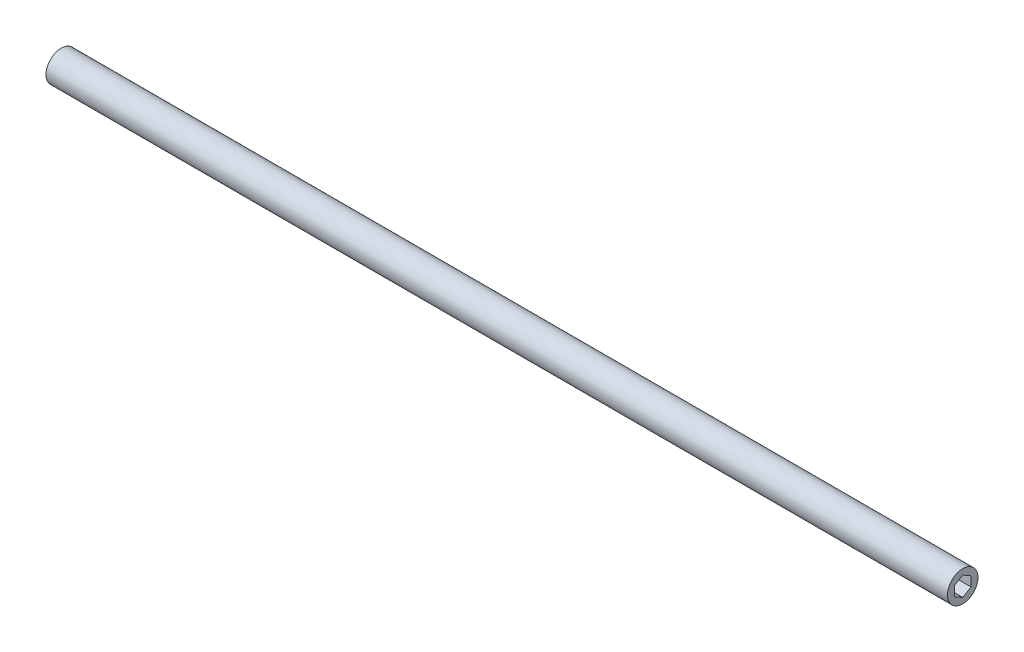
ISO-10303-21;
HEADER;
FILE_DESCRIPTION(('STEP AP214'),'2;1');
FILE_NAME('part.step','',(''),(''),'','','');
FILE_SCHEMA(('AUTOMOTIVE_DESIGN { 1 0 10303 214 1 1 1 1 }'));
ENDSEC;
DATA;
#1=APPLICATION_CONTEXT('core data for automotive mechanical design processes');
#2=APPLICATION_PROTOCOL_DEFINITION('international standard','automotive_design',2000,#1);
#3=PRODUCT_CONTEXT('',#1,'mechanical');
#4=PRODUCT('Part','Part','',(#3));
#5=PRODUCT_RELATED_PRODUCT_CATEGORY('part','',(#4));
#6=PRODUCT_DEFINITION_FORMATION('','',#4);
#7=PRODUCT_DEFINITION_CONTEXT('part definition',#1,'design');
#8=PRODUCT_DEFINITION('design','',#6,#7);
#9=PRODUCT_DEFINITION_SHAPE('','',#8);
#10=(LENGTH_UNIT() NAMED_UNIT(*) SI_UNIT(.MILLI.,.METRE.));
#11=(NAMED_UNIT(*) PLANE_ANGLE_UNIT() SI_UNIT($,.RADIAN.));
#12=(NAMED_UNIT(*) SI_UNIT($,.STERADIAN.) SOLID_ANGLE_UNIT());
#13=UNCERTAINTY_MEASURE_WITH_UNIT(LENGTH_MEASURE(1.E-05),#10,'distance_accuracy_value','');
#14=(GEOMETRIC_REPRESENTATION_CONTEXT(3) GLOBAL_UNCERTAINTY_ASSIGNED_CONTEXT((#13)) GLOBAL_UNIT_ASSIGNED_CONTEXT((#10,
#11,#12)) REPRESENTATION_CONTEXT('',''));
#15=CARTESIAN_POINT('',(0.,0.,0.));
#16=DIRECTION('',(0.,0.,1.));
#17=DIRECTION('',(1.,0.,0.));
#18=AXIS2_PLACEMENT_3D('',#15,#16,#17);
#19=CARTESIAN_POINT('',(682.625,0.,0.));
#20=DIRECTION('',(1.,0.,0.));
#21=DIRECTION('',(0.,0.,-1.));
#22=AXIS2_PLACEMENT_3D('',#19,#20,#21);
#23=PLANE('',#22);
#24=CARTESIAN_POINT('',(682.625,0.,0.));
#25=DIRECTION('',(1.,0.,0.));
#26=DIRECTION('',(0.,0.,-1.));
#27=AXIS2_PLACEMENT_3D('',#24,#25,#26);
#28=CIRCLE('',#27,11.557);
#29=CARTESIAN_POINT('',(682.625,0.,-11.557));
#30=VERTEX_POINT('',#29);
#31=EDGE_CURVE('E11',#30,#30,#28,.T.);
#32=ORIENTED_EDGE('',*,*,#31,.T.);
#33=EDGE_LOOP('',(#32));
#34=FACE_BOUND('',#33,.T.);
#35=DIRECTION('',(0.,-0.500000000000001,0.866025403784438));
#36=VECTOR('',#35,1.);
#37=CARTESIAN_POINT('',(682.625,7.33234841870825,0.));
#38=LINE('',#37,#36);
#39=CARTESIAN_POINT('',(682.625,7.33234841870825,0.));
#40=VERTEX_POINT('',#39);
#41=CARTESIAN_POINT('',(682.625,3.66617420935411,6.35000000000001));
#42=VERTEX_POINT('',#41);
#43=EDGE_CURVE('E102',#40,#42,#38,.T.);
#44=ORIENTED_EDGE('',*,*,#43,.F.);
#45=DIRECTION('',(0.,0.499999999999995,0.866025403784441));
#46=VECTOR('',#45,1.);
#47=CARTESIAN_POINT('',(682.625,3.6661742093542,-6.34999999999996));
#48=LINE('',#47,#46);
#49=CARTESIAN_POINT('',(682.625,3.6661742093542,-6.34999999999996));
#50=VERTEX_POINT('',#49);
#51=EDGE_CURVE('E94',#50,#40,#48,.T.);
#52=ORIENTED_EDGE('',*,*,#51,.F.);
#53=DIRECTION('',(0.,1.,0.));
#54=VECTOR('',#53,1.);
#55=CARTESIAN_POINT('',(682.625,-3.66617420935407,-6.35000000000004));
#56=LINE('',#55,#54);
#57=CARTESIAN_POINT('',(682.625,-3.66617420935407,-6.35000000000004));
#58=VERTEX_POINT('',#57);
#59=EDGE_CURVE('E124',#58,#50,#56,.T.);
#60=ORIENTED_EDGE('',*,*,#59,.F.);
#61=DIRECTION('',(0.,0.500000000000007,-0.866025403784435));
#62=VECTOR('',#61,1.);
#63=CARTESIAN_POINT('',(682.625,-7.33234841870825,0.));
#64=LINE('',#63,#62);
#65=CARTESIAN_POINT('',(682.625,-7.33234841870825,0.));
#66=VERTEX_POINT('',#65);
#67=EDGE_CURVE('E122',#66,#58,#64,.T.);
#68=ORIENTED_EDGE('',*,*,#67,.F.);
#69=DIRECTION('',(0.,-0.499999999999995,-0.866025403784442));
#70=VECTOR('',#69,1.);
#71=CARTESIAN_POINT('',(682.625,-3.66617420935416,6.34999999999999));
#72=LINE('',#71,#70);
#73=CARTESIAN_POINT('',(682.625,-3.66617420935416,6.34999999999999));
#74=VERTEX_POINT('',#73);
#75=EDGE_CURVE('E117',#74,#66,#72,.T.);
#76=ORIENTED_EDGE('',*,*,#75,.F.);
#77=DIRECTION('',(0.,-1.,0.));
#78=VECTOR('',#77,1.);
#79=CARTESIAN_POINT('',(682.625,3.66617420935411,6.35000000000001));
#80=LINE('',#79,#78);
#81=EDGE_CURVE('E114',#42,#74,#80,.T.);
#82=ORIENTED_EDGE('',*,*,#81,.F.);
#83=EDGE_LOOP('',(#44,#52,#60,#68,#76,#82));
#84=FACE_BOUND('',#83,.T.);
#85=ADVANCED_FACE('F39',(#34,#84),#23,.T.);
#86=CARTESIAN_POINT('',(0.,0.,0.));
#87=DIRECTION('',(1.,0.,0.));
#88=DIRECTION('',(0.,0.,-1.));
#89=AXIS2_PLACEMENT_3D('',#86,#87,#88);
#90=PLANE('',#89);
#91=CARTESIAN_POINT('',(0.,0.,0.));
#92=DIRECTION('',(1.,0.,0.));
#93=DIRECTION('',(0.,0.,-1.));
#94=AXIS2_PLACEMENT_3D('',#91,#92,#93);
#95=CIRCLE('',#94,11.557);
#96=CARTESIAN_POINT('',(0.,0.,-11.557));
#97=VERTEX_POINT('',#96);
#98=EDGE_CURVE('E43',#97,#97,#95,.T.);
#99=ORIENTED_EDGE('',*,*,#98,.F.);
#100=EDGE_LOOP('',(#99));
#101=FACE_BOUND('',#100,.T.);
#102=DIRECTION('',(0.,0.499999999999995,0.866025403784441));
#103=VECTOR('',#102,1.);
#104=CARTESIAN_POINT('',(0.,3.6661742093542,-6.34999999999996));
#105=LINE('',#104,#103);
#106=CARTESIAN_POINT('',(0.,3.6661742093542,-6.34999999999996));
#107=VERTEX_POINT('',#106);
#108=CARTESIAN_POINT('',(0.,7.33234841870825,0.));
#109=VERTEX_POINT('',#108);
#110=EDGE_CURVE('E63',#107,#109,#105,.T.);
#111=ORIENTED_EDGE('',*,*,#110,.T.);
#112=DIRECTION('',(0.,-0.500000000000001,0.866025403784438));
#113=VECTOR('',#112,1.);
#114=CARTESIAN_POINT('',(0.,7.33234841870825,0.));
#115=LINE('',#114,#113);
#116=CARTESIAN_POINT('',(0.,3.66617420935411,6.35000000000001));
#117=VERTEX_POINT('',#116);
#118=EDGE_CURVE('E109',#109,#117,#115,.T.);
#119=ORIENTED_EDGE('',*,*,#118,.T.);
#120=DIRECTION('',(0.,-1.,0.));
#121=VECTOR('',#120,1.);
#122=CARTESIAN_POINT('',(0.,3.66617420935411,6.35000000000001));
#123=LINE('',#122,#121);
#124=CARTESIAN_POINT('',(0.,-3.66617420935416,6.34999999999999));
#125=VERTEX_POINT('',#124);
#126=EDGE_CURVE('E128',#117,#125,#123,.T.);
#127=ORIENTED_EDGE('',*,*,#126,.T.);
#128=DIRECTION('',(0.,-0.499999999999995,-0.866025403784442));
#129=VECTOR('',#128,1.);
#130=CARTESIAN_POINT('',(0.,-3.66617420935416,6.34999999999999));
#131=LINE('',#130,#129);
#132=CARTESIAN_POINT('',(0.,-7.33234841870825,0.));
#133=VERTEX_POINT('',#132);
#134=EDGE_CURVE('E131',#125,#133,#131,.T.);
#135=ORIENTED_EDGE('',*,*,#134,.T.);
#136=DIRECTION('',(0.,0.500000000000007,-0.866025403784435));
#137=VECTOR('',#136,1.);
#138=CARTESIAN_POINT('',(0.,-7.33234841870825,0.));
#139=LINE('',#138,#137);
#140=CARTESIAN_POINT('',(0.,-3.66617420935407,-6.35000000000004));
#141=VERTEX_POINT('',#140);
#142=EDGE_CURVE('E134',#133,#141,#139,.T.);
#143=ORIENTED_EDGE('',*,*,#142,.T.);
#144=DIRECTION('',(0.,1.,0.));
#145=VECTOR('',#144,1.);
#146=CARTESIAN_POINT('',(0.,-3.66617420935407,-6.35000000000004));
#147=LINE('',#146,#145);
#148=EDGE_CURVE('E103',#141,#107,#147,.T.);
#149=ORIENTED_EDGE('',*,*,#148,.T.);
#150=EDGE_LOOP('',(#111,#119,#127,#135,#143,#149));
#151=FACE_BOUND('',#150,.T.);
#152=ADVANCED_FACE('F153',(#101,#151),#90,.F.);
#153=CARTESIAN_POINT('',(682.625,0.,0.));
#154=DIRECTION('',(-1.,0.,0.));
#155=DIRECTION('',(0.,0.,1.));
#156=AXIS2_PLACEMENT_3D('',#153,#154,#155);
#157=CYLINDRICAL_SURFACE('',#156,11.557);
#158=ORIENTED_EDGE('',*,*,#31,.F.);
#159=EDGE_LOOP('',(#158));
#160=FACE_BOUND('',#159,.T.);
#161=ORIENTED_EDGE('',*,*,#98,.T.);
#162=EDGE_LOOP('',(#161));
#163=FACE_BOUND('',#162,.T.);
#164=ADVANCED_FACE('F41',(#160,#163),#157,.T.);
#165=CARTESIAN_POINT('',(682.625,3.6661742093542,-6.34999999999996));
#166=DIRECTION('',(0.,-0.866025403784442,0.499999999999995));
#167=DIRECTION('',(0.,-0.499999999999995,-0.866025403784442));
#168=AXIS2_PLACEMENT_3D('',#165,#166,#167);
#169=PLANE('',#168);
#170=ORIENTED_EDGE('',*,*,#110,.F.);
#171=DIRECTION('',(-1.,0.,0.));
#172=VECTOR('',#171,1.);
#173=CARTESIAN_POINT('',(682.625,3.6661742093542,-6.34999999999996));
#174=LINE('',#173,#172);
#175=EDGE_CURVE('E98',#50,#107,#174,.T.);
#176=ORIENTED_EDGE('',*,*,#175,.F.);
#177=ORIENTED_EDGE('',*,*,#51,.T.);
#178=DIRECTION('',(-1.,0.,0.));
#179=VECTOR('',#178,1.);
#180=CARTESIAN_POINT('',(682.625,7.33234841870825,0.));
#181=LINE('',#180,#179);
#182=EDGE_CURVE('E97',#40,#109,#181,.T.);
#183=ORIENTED_EDGE('',*,*,#182,.T.);
#184=EDGE_LOOP('',(#170,#176,#177,#183));
#185=FACE_BOUND('',#184,.T.);
#186=ADVANCED_FACE('F96',(#185),#169,.T.);
#187=CARTESIAN_POINT('',(682.625,7.33234841870825,0.));
#188=DIRECTION('',(0.,-0.866025403784438,-0.500000000000001));
#189=DIRECTION('',(0.,0.500000000000001,-0.866025403784438));
#190=AXIS2_PLACEMENT_3D('',#187,#188,#189);
#191=PLANE('',#190);
#192=ORIENTED_EDGE('',*,*,#118,.F.);
#193=ORIENTED_EDGE('',*,*,#182,.F.);
#194=ORIENTED_EDGE('',*,*,#43,.T.);
#195=DIRECTION('',(-1.,0.,0.));
#196=VECTOR('',#195,1.);
#197=CARTESIAN_POINT('',(682.625,3.66617420935411,6.35000000000001));
#198=LINE('',#197,#196);
#199=EDGE_CURVE('E110',#42,#117,#198,.T.);
#200=ORIENTED_EDGE('',*,*,#199,.T.);
#201=EDGE_LOOP('',(#192,#193,#194,#200));
#202=FACE_BOUND('',#201,.T.);
#203=ADVANCED_FACE('F106',(#202),#191,.T.);
#204=CARTESIAN_POINT('',(682.625,3.66617420935411,6.35000000000001));
#205=DIRECTION('',(0.,0.,-1.));
#206=DIRECTION('',(0.,1.,0.));
#207=AXIS2_PLACEMENT_3D('',#204,#205,#206);
#208=PLANE('',#207);
#209=ORIENTED_EDGE('',*,*,#126,.F.);
#210=ORIENTED_EDGE('',*,*,#199,.F.);
#211=ORIENTED_EDGE('',*,*,#81,.T.);
#212=DIRECTION('',(-1.,0.,0.));
#213=VECTOR('',#212,1.);
#214=CARTESIAN_POINT('',(682.625,-3.66617420935416,6.34999999999999));
#215=LINE('',#214,#213);
#216=EDGE_CURVE('E143',#74,#125,#215,.T.);
#217=ORIENTED_EDGE('',*,*,#216,.T.);
#218=EDGE_LOOP('',(#209,#210,#211,#217));
#219=FACE_BOUND('',#218,.T.);
#220=ADVANCED_FACE('F149',(#219),#208,.T.);
#221=CARTESIAN_POINT('',(682.625,-3.66617420935416,6.34999999999999));
#222=DIRECTION('',(0.,0.866025403784442,-0.499999999999995));
#223=DIRECTION('',(0.,0.499999999999995,0.866025403784442));
#224=AXIS2_PLACEMENT_3D('',#221,#222,#223);
#225=PLANE('',#224);
#226=ORIENTED_EDGE('',*,*,#134,.F.);
#227=ORIENTED_EDGE('',*,*,#216,.F.);
#228=ORIENTED_EDGE('',*,*,#75,.T.);
#229=DIRECTION('',(-1.,0.,0.));
#230=VECTOR('',#229,1.);
#231=CARTESIAN_POINT('',(682.625,-7.33234841870825,0.));
#232=LINE('',#231,#230);
#233=EDGE_CURVE('E141',#66,#133,#232,.T.);
#234=ORIENTED_EDGE('',*,*,#233,.T.);
#235=EDGE_LOOP('',(#226,#227,#228,#234));
#236=FACE_BOUND('',#235,.T.);
#237=ADVANCED_FACE('F161',(#236),#225,.T.);
#238=CARTESIAN_POINT('',(682.625,-7.33234841870825,0.));
#239=DIRECTION('',(0.,0.866025403784435,0.500000000000007));
#240=DIRECTION('',(0.,-0.500000000000007,0.866025403784435));
#241=AXIS2_PLACEMENT_3D('',#238,#239,#240);
#242=PLANE('',#241);
#243=ORIENTED_EDGE('',*,*,#142,.F.);
#244=ORIENTED_EDGE('',*,*,#233,.F.);
#245=ORIENTED_EDGE('',*,*,#67,.T.);
#246=DIRECTION('',(-1.,0.,0.));
#247=VECTOR('',#246,1.);
#248=CARTESIAN_POINT('',(682.625,-3.66617420935407,-6.35000000000004));
#249=LINE('',#248,#247);
#250=EDGE_CURVE('E55',#58,#141,#249,.T.);
#251=ORIENTED_EDGE('',*,*,#250,.T.);
#252=EDGE_LOOP('',(#243,#244,#245,#251));
#253=FACE_BOUND('',#252,.T.);
#254=ADVANCED_FACE('F159',(#253),#242,.T.);
#255=CARTESIAN_POINT('',(682.625,-3.66617420935407,-6.35000000000004));
#256=DIRECTION('',(0.,0.,1.));
#257=DIRECTION('',(0.,-1.,0.));
#258=AXIS2_PLACEMENT_3D('',#255,#256,#257);
#259=PLANE('',#258);
#260=ORIENTED_EDGE('',*,*,#148,.F.);
#261=ORIENTED_EDGE('',*,*,#250,.F.);
#262=ORIENTED_EDGE('',*,*,#59,.T.);
#263=ORIENTED_EDGE('',*,*,#175,.T.);
#264=EDGE_LOOP('',(#260,#261,#262,#263));
#265=FACE_BOUND('',#264,.T.);
#266=ADVANCED_FACE('F155',(#265),#259,.T.);
#267=CLOSED_SHELL('',(#85,#152,#164,#186,#203,#220,#237,#254,#266));
#268=MANIFOLD_SOLID_BREP('B2',#267);
#269=ADVANCED_BREP_SHAPE_REPRESENTATION('',(#18,#268),#14);
#270=SHAPE_DEFINITION_REPRESENTATION(#9,#269);
ENDSEC;
END-ISO-10303-21;
